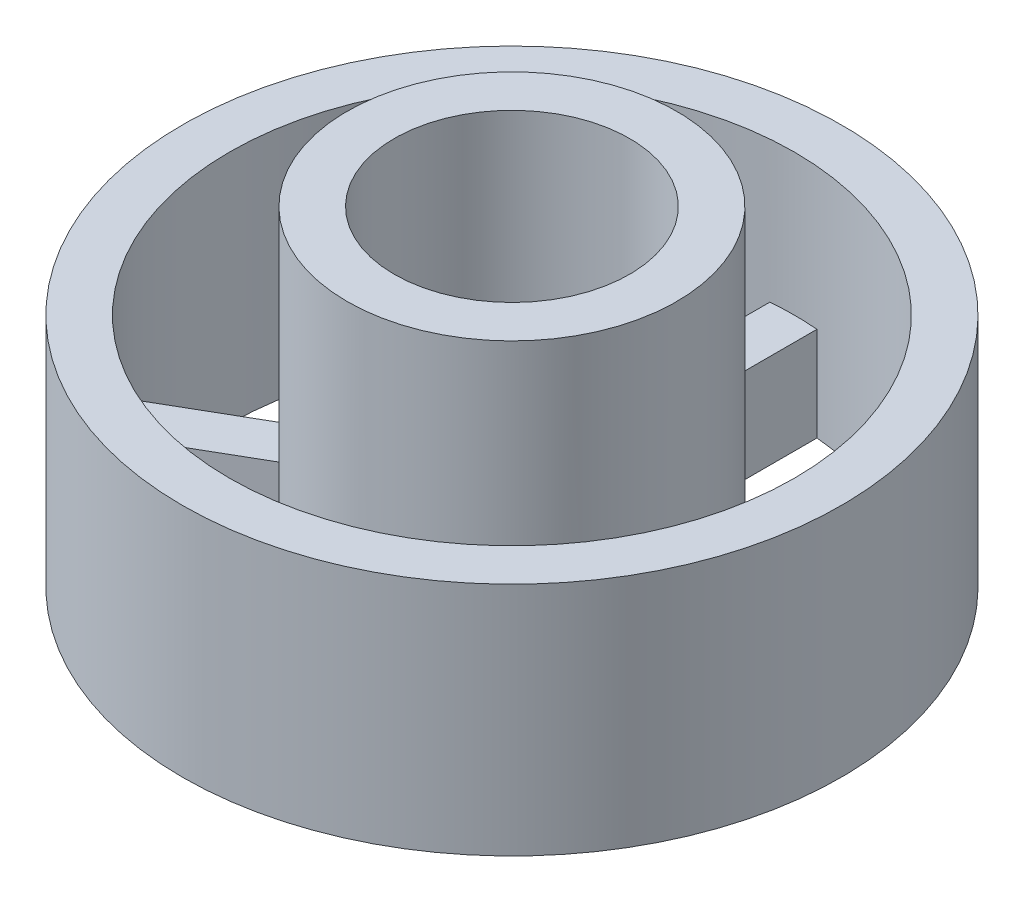
ISO-10303-21;
HEADER;
FILE_DESCRIPTION(('STEP AP214'),'2;1');
FILE_NAME('part.step','',(''),(''),'','','');
FILE_SCHEMA(('AUTOMOTIVE_DESIGN { 1 0 10303 214 1 1 1 1 }'));
ENDSEC;
DATA;
#1=APPLICATION_CONTEXT('core data for automotive mechanical design processes');
#2=APPLICATION_PROTOCOL_DEFINITION('international standard','automotive_design',2000,#1);
#3=PRODUCT_CONTEXT('',#1,'mechanical');
#4=PRODUCT('Part','Part','',(#3));
#5=PRODUCT_RELATED_PRODUCT_CATEGORY('part','',(#4));
#6=PRODUCT_DEFINITION_FORMATION('','',#4);
#7=PRODUCT_DEFINITION_CONTEXT('part definition',#1,'design');
#8=PRODUCT_DEFINITION('design','',#6,#7);
#9=PRODUCT_DEFINITION_SHAPE('','',#8);
#10=(LENGTH_UNIT() NAMED_UNIT(*) SI_UNIT(.MILLI.,.METRE.));
#11=(NAMED_UNIT(*) PLANE_ANGLE_UNIT() SI_UNIT($,.RADIAN.));
#12=(NAMED_UNIT(*) SI_UNIT($,.STERADIAN.) SOLID_ANGLE_UNIT());
#13=UNCERTAINTY_MEASURE_WITH_UNIT(LENGTH_MEASURE(1.E-05),#10,'distance_accuracy_value','');
#14=(GEOMETRIC_REPRESENTATION_CONTEXT(3) GLOBAL_UNCERTAINTY_ASSIGNED_CONTEXT((#13)) GLOBAL_UNIT_ASSIGNED_CONTEXT((#10,
#11,#12)) REPRESENTATION_CONTEXT('',''));
#15=CARTESIAN_POINT('',(0.,0.,0.));
#16=DIRECTION('',(0.,0.,1.));
#17=DIRECTION('',(1.,0.,0.));
#18=AXIS2_PLACEMENT_3D('',#15,#16,#17);
#19=CARTESIAN_POINT('',(0.,2.,0.));
#20=DIRECTION('',(0.,1.,0.));
#21=DIRECTION('',(0.,0.,1.));
#22=AXIS2_PLACEMENT_3D('',#19,#20,#21);
#23=PLANE('',#22);
#24=DIRECTION('',(-0.866025403784436,0.,0.500000000000004));
#25=VECTOR('',#24,1.);
#26=CARTESIAN_POINT('',(-4.92807879430198,2.,3.42257788766759));
#27=LINE('',#26,#25);
#28=CARTESIAN_POINT('',(-2.74999999999999,2.,2.16506350946111));
#29=VERTEX_POINT('',#28);
#30=CARTESIAN_POINT('',(-4.92807879430198,2.,3.42257788766759));
#31=VERTEX_POINT('',#30);
#32=EDGE_CURVE('E177',#29,#31,#27,.T.);
#33=ORIENTED_EDGE('',*,*,#32,.F.);
#34=CARTESIAN_POINT('',(0.,2.,0.));
#35=DIRECTION('',(0.,1.,0.));
#36=DIRECTION('',(0.,0.,1.));
#37=AXIS2_PLACEMENT_3D('',#34,#35,#36);
#38=CIRCLE('',#37,3.5);
#39=CARTESIAN_POINT('',(-3.25,2.,1.29903810567667));
#40=VERTEX_POINT('',#39);
#41=EDGE_CURVE('E255',#40,#29,#38,.T.);
#42=ORIENTED_EDGE('',*,*,#41,.F.);
#43=DIRECTION('',(0.866025403784437,0.,-0.500000000000003));
#44=VECTOR('',#43,1.);
#45=CARTESIAN_POINT('',(-5.42807879430199,2.,2.55655248388315));
#46=LINE('',#45,#44);
#47=CARTESIAN_POINT('',(-5.42807879430199,2.,2.55655248388315));
#48=VERTEX_POINT('',#47);
#49=EDGE_CURVE('E209',#48,#40,#46,.T.);
#50=ORIENTED_EDGE('',*,*,#49,.F.);
#51=CARTESIAN_POINT('',(0.,2.,0.));
#52=DIRECTION('',(0.,1.,0.));
#53=DIRECTION('',(0.,0.,1.));
#54=AXIS2_PLACEMENT_3D('',#51,#52,#53);
#55=CIRCLE('',#54,6.);
#56=EDGE_CURVE('E273',#48,#31,#55,.T.);
#57=ORIENTED_EDGE('',*,*,#56,.T.);
#58=EDGE_LOOP('',(#33,#42,#50,#57));
#59=FACE_BOUND('',#58,.T.);
#60=ADVANCED_FACE('F39',(#59),#23,.T.);
#61=DIRECTION('',(0.,0.,1.));
#62=VECTOR('',#61,1.);
#63=CARTESIAN_POINT('',(0.499999999999998,2.,-5.9791303715507));
#64=LINE('',#63,#62);
#65=CARTESIAN_POINT('',(0.499999999999998,2.,-5.9791303715507));
#66=VERTEX_POINT('',#65);
#67=CARTESIAN_POINT('',(0.499999999999999,2.,-3.46410161513776));
#68=VERTEX_POINT('',#67);
#69=EDGE_CURVE('E165',#66,#68,#64,.T.);
#70=ORIENTED_EDGE('',*,*,#69,.F.);
#71=CARTESIAN_POINT('',(-0.500000000000001,2.,-5.9791303715507));
#72=VERTEX_POINT('',#71);
#73=EDGE_CURVE('E140',#66,#72,#55,.T.);
#74=ORIENTED_EDGE('',*,*,#73,.T.);
#75=DIRECTION('',(0.,0.,-1.));
#76=VECTOR('',#75,1.);
#77=CARTESIAN_POINT('',(-0.500000000000001,2.,-5.9791303715507));
#78=LINE('',#77,#76);
#79=CARTESIAN_POINT('',(-0.5,2.,-3.46410161513776));
#80=VERTEX_POINT('',#79);
#81=EDGE_CURVE('E222',#80,#72,#78,.T.);
#82=ORIENTED_EDGE('',*,*,#81,.F.);
#83=EDGE_CURVE('E268',#68,#80,#38,.T.);
#84=ORIENTED_EDGE('',*,*,#83,.F.);
#85=EDGE_LOOP('',(#70,#74,#82,#84));
#86=FACE_BOUND('',#85,.T.);
#87=ADVANCED_FACE('F285',(#86),#23,.T.);
#88=CARTESIAN_POINT('',(0.,5.,0.));
#89=DIRECTION('',(0.,-1.,0.));
#90=DIRECTION('',(0.,0.,-1.));
#91=AXIS2_PLACEMENT_3D('',#88,#89,#90);
#92=CYLINDRICAL_SURFACE('',#91,7.);
#93=CARTESIAN_POINT('',(0.,5.,0.));
#94=DIRECTION('',(0.,1.,0.));
#95=DIRECTION('',(0.,0.,1.));
#96=AXIS2_PLACEMENT_3D('',#93,#94,#95);
#97=CIRCLE('',#96,7.);
#98=CARTESIAN_POINT('',(0.,5.,7.));
#99=VERTEX_POINT('',#98);
#100=EDGE_CURVE('E11',#99,#99,#97,.T.);
#101=ORIENTED_EDGE('',*,*,#100,.F.);
#102=EDGE_LOOP('',(#101));
#103=FACE_BOUND('',#102,.T.);
#104=CARTESIAN_POINT('',(0.,0.,0.));
#105=DIRECTION('',(0.,1.,0.));
#106=DIRECTION('',(0.,0.,1.));
#107=AXIS2_PLACEMENT_3D('',#104,#105,#106);
#108=CIRCLE('',#107,7.);
#109=CARTESIAN_POINT('',(0.,0.,7.));
#110=VERTEX_POINT('',#109);
#111=EDGE_CURVE('E43',#110,#110,#108,.T.);
#112=ORIENTED_EDGE('',*,*,#111,.T.);
#113=EDGE_LOOP('',(#112));
#114=FACE_BOUND('',#113,.T.);
#115=ADVANCED_FACE('F41',(#103,#114),#92,.T.);
#116=CARTESIAN_POINT('',(0.,5.,0.));
#117=DIRECTION('',(0.,1.,0.));
#118=DIRECTION('',(0.,0.,1.));
#119=AXIS2_PLACEMENT_3D('',#116,#117,#118);
#120=PLANE('',#119);
#121=CARTESIAN_POINT('',(0.,5.,0.));
#122=DIRECTION('',(0.,1.,0.));
#123=DIRECTION('',(0.,0.,1.));
#124=AXIS2_PLACEMENT_3D('',#121,#122,#123);
#125=CIRCLE('',#124,6.);
#126=CARTESIAN_POINT('',(0.,5.,6.));
#127=VERTEX_POINT('',#126);
#128=EDGE_CURVE('E263',#127,#127,#125,.T.);
#129=ORIENTED_EDGE('',*,*,#128,.F.);
#130=EDGE_LOOP('',(#129));
#131=FACE_BOUND('',#130,.T.);
#132=ORIENTED_EDGE('',*,*,#100,.T.);
#133=EDGE_LOOP('',(#132));
#134=FACE_BOUND('',#133,.T.);
#135=ADVANCED_FACE('F342',(#131,#134),#120,.T.);
#136=CARTESIAN_POINT('',(0.,0.,0.));
#137=DIRECTION('',(0.,1.,0.));
#138=DIRECTION('',(0.,0.,1.));
#139=AXIS2_PLACEMENT_3D('',#136,#137,#138);
#140=PLANE('',#139);
#141=DIRECTION('',(-0.866025403784436,0.,-0.500000000000005));
#142=VECTOR('',#141,1.);
#143=CARTESIAN_POINT('',(4.92807879430199,0.,3.42257788766758));
#144=LINE('',#143,#142);
#145=CARTESIAN_POINT('',(4.92807879430199,0.,3.42257788766758));
#146=VERTEX_POINT('',#145);
#147=CARTESIAN_POINT('',(2.75000000000001,0.,2.16506350946109));
#148=VERTEX_POINT('',#147);
#149=EDGE_CURVE('E196',#146,#148,#144,.T.);
#150=ORIENTED_EDGE('',*,*,#149,.T.);
#151=CARTESIAN_POINT('',(0.,0.,0.));
#152=DIRECTION('',(0.,-1.,0.));
#153=DIRECTION('',(0.,0.,1.));
#154=AXIS2_PLACEMENT_3D('',#151,#152,#153);
#155=CIRCLE('',#154,3.5);
#156=CARTESIAN_POINT('',(-2.74999999999999,0.,2.16506350946111));
#157=VERTEX_POINT('',#156);
#158=EDGE_CURVE('E183',#148,#157,#155,.T.);
#159=ORIENTED_EDGE('',*,*,#158,.T.);
#160=DIRECTION('',(-0.866025403784436,0.,0.500000000000004));
#161=VECTOR('',#160,1.);
#162=CARTESIAN_POINT('',(-4.92807879430198,0.,3.42257788766759));
#163=LINE('',#162,#161);
#164=CARTESIAN_POINT('',(-4.92807879430198,0.,3.42257788766759));
#165=VERTEX_POINT('',#164);
#166=EDGE_CURVE('E187',#157,#165,#163,.T.);
#167=ORIENTED_EDGE('',*,*,#166,.T.);
#168=CARTESIAN_POINT('',(0.,0.,0.));
#169=DIRECTION('',(0.,1.,0.));
#170=DIRECTION('',(0.,0.,1.));
#171=AXIS2_PLACEMENT_3D('',#168,#169,#170);
#172=CIRCLE('',#171,6.);
#173=EDGE_CURVE('E192',#165,#146,#172,.T.);
#174=ORIENTED_EDGE('',*,*,#173,.T.);
#175=EDGE_LOOP('',(#150,#159,#167,#174));
#176=FACE_BOUND('',#175,.T.);
#177=DIRECTION('',(0.866025403784436,0.,0.500000000000005));
#178=VECTOR('',#177,1.);
#179=CARTESIAN_POINT('',(5.42807879430198,0.,2.55655248388316));
#180=LINE('',#179,#178);
#181=CARTESIAN_POINT('',(3.24999999999999,0.,1.29903810567668));
#182=VERTEX_POINT('',#181);
#183=CARTESIAN_POINT('',(5.42807879430198,0.,2.55655248388316));
#184=VERTEX_POINT('',#183);
#185=EDGE_CURVE('E146',#182,#184,#180,.T.);
#186=ORIENTED_EDGE('',*,*,#185,.T.);
#187=CARTESIAN_POINT('',(0.,0.,0.));
#188=DIRECTION('',(0.,1.,0.));
#189=DIRECTION('',(0.,0.,1.));
#190=AXIS2_PLACEMENT_3D('',#187,#188,#189);
#191=CIRCLE('',#190,6.);
#192=CARTESIAN_POINT('',(0.499999999999998,0.,-5.9791303715507));
#193=VERTEX_POINT('',#192);
#194=EDGE_CURVE('E137',#184,#193,#191,.T.);
#195=ORIENTED_EDGE('',*,*,#194,.T.);
#196=DIRECTION('',(0.,0.,1.));
#197=VECTOR('',#196,1.);
#198=CARTESIAN_POINT('',(0.499999999999998,0.,-5.9791303715507));
#199=LINE('',#198,#197);
#200=CARTESIAN_POINT('',(0.499999999999999,0.,-3.46410161513776));
#201=VERTEX_POINT('',#200);
#202=EDGE_CURVE('E150',#193,#201,#199,.T.);
#203=ORIENTED_EDGE('',*,*,#202,.T.);
#204=CARTESIAN_POINT('',(0.,0.,0.));
#205=DIRECTION('',(0.,-1.,0.));
#206=DIRECTION('',(0.,0.,1.));
#207=AXIS2_PLACEMENT_3D('',#204,#205,#206);
#208=CIRCLE('',#207,3.5);
#209=EDGE_CURVE('E155',#201,#182,#208,.T.);
#210=ORIENTED_EDGE('',*,*,#209,.T.);
#211=EDGE_LOOP('',(#186,#195,#203,#210));
#212=FACE_BOUND('',#211,.T.);
#213=DIRECTION('',(0.,0.,-1.));
#214=VECTOR('',#213,1.);
#215=CARTESIAN_POINT('',(-0.500000000000001,0.,-5.9791303715507));
#216=LINE('',#215,#214);
#217=CARTESIAN_POINT('',(-0.5,0.,-3.46410161513776));
#218=VERTEX_POINT('',#217);
#219=CARTESIAN_POINT('',(-0.500000000000001,0.,-5.9791303715507));
#220=VERTEX_POINT('',#219);
#221=EDGE_CURVE('E230',#218,#220,#216,.T.);
#222=ORIENTED_EDGE('',*,*,#221,.T.);
#223=CARTESIAN_POINT('',(0.,0.,0.));
#224=DIRECTION('',(0.,1.,0.));
#225=DIRECTION('',(0.,0.,1.));
#226=AXIS2_PLACEMENT_3D('',#223,#224,#225);
#227=CIRCLE('',#226,6.);
#228=CARTESIAN_POINT('',(-5.42807879430199,0.,2.55655248388315));
#229=VERTEX_POINT('',#228);
#230=EDGE_CURVE('E217',#220,#229,#227,.T.);
#231=ORIENTED_EDGE('',*,*,#230,.T.);
#232=DIRECTION('',(0.866025403784437,0.,-0.500000000000003));
#233=VECTOR('',#232,1.);
#234=CARTESIAN_POINT('',(-5.42807879430199,0.,2.55655248388315));
#235=LINE('',#234,#233);
#236=CARTESIAN_POINT('',(-3.25,0.,1.29903810567667));
#237=VERTEX_POINT('',#236);
#238=EDGE_CURVE('E221',#229,#237,#235,.T.);
#239=ORIENTED_EDGE('',*,*,#238,.T.);
#240=CARTESIAN_POINT('',(0.,0.,0.));
#241=DIRECTION('',(0.,-1.,0.));
#242=DIRECTION('',(0.,0.,1.));
#243=AXIS2_PLACEMENT_3D('',#240,#241,#242);
#244=CIRCLE('',#243,3.5);
#245=EDGE_CURVE('E226',#237,#218,#244,.T.);
#246=ORIENTED_EDGE('',*,*,#245,.T.);
#247=EDGE_LOOP('',(#222,#231,#239,#246));
#248=FACE_BOUND('',#247,.T.);
#249=CARTESIAN_POINT('',(0.,0.,0.));
#250=DIRECTION('',(0.,1.,0.));
#251=DIRECTION('',(0.,0.,1.));
#252=AXIS2_PLACEMENT_3D('',#249,#250,#251);
#253=CIRCLE('',#252,2.5);
#254=CARTESIAN_POINT('',(0.,0.,2.5));
#255=VERTEX_POINT('',#254);
#256=EDGE_CURVE('E251',#255,#255,#253,.T.);
#257=ORIENTED_EDGE('',*,*,#256,.T.);
#258=EDGE_LOOP('',(#257));
#259=FACE_BOUND('',#258,.T.);
#260=ORIENTED_EDGE('',*,*,#111,.F.);
#261=EDGE_LOOP('',(#260));
#262=FACE_BOUND('',#261,.T.);
#263=ADVANCED_FACE('F157',(#176,#212,#248,#259,#262),#140,.F.);
#264=CARTESIAN_POINT('',(0.,2.,0.));
#265=DIRECTION('',(0.,1.,0.));
#266=DIRECTION('',(0.,0.,1.));
#267=AXIS2_PLACEMENT_3D('',#264,#265,#266);
#268=CYLINDRICAL_SURFACE('',#267,6.);
#269=CARTESIAN_POINT('',(4.92807879430199,2.,3.42257788766758));
#270=VERTEX_POINT('',#269);
#271=CARTESIAN_POINT('',(5.42807879430198,2.,2.55655248388316));
#272=VERTEX_POINT('',#271);
#273=EDGE_CURVE('E269',#270,#272,#55,.T.);
#274=ORIENTED_EDGE('',*,*,#273,.F.);
#275=DIRECTION('',(0.,1.,0.));
#276=VECTOR('',#275,1.);
#277=CARTESIAN_POINT('',(4.92807879430199,0.,3.42257788766758));
#278=LINE('',#277,#276);
#279=EDGE_CURVE('E55',#146,#270,#278,.T.);
#280=ORIENTED_EDGE('',*,*,#279,.F.);
#281=ORIENTED_EDGE('',*,*,#173,.F.);
#282=DIRECTION('',(0.,1.,0.));
#283=VECTOR('',#282,1.);
#284=CARTESIAN_POINT('',(-4.92807879430198,0.,3.42257788766759));
#285=LINE('',#284,#283);
#286=EDGE_CURVE('E212',#165,#31,#285,.T.);
#287=ORIENTED_EDGE('',*,*,#286,.T.);
#288=ORIENTED_EDGE('',*,*,#56,.F.);
#289=DIRECTION('',(0.,1.,0.));
#290=VECTOR('',#289,1.);
#291=CARTESIAN_POINT('',(-5.42807879430199,0.,2.55655248388315));
#292=LINE('',#291,#290);
#293=EDGE_CURVE('E234',#229,#48,#292,.T.);
#294=ORIENTED_EDGE('',*,*,#293,.F.);
#295=ORIENTED_EDGE('',*,*,#230,.F.);
#296=DIRECTION('',(0.,1.,0.));
#297=VECTOR('',#296,1.);
#298=CARTESIAN_POINT('',(-0.500000000000001,0.,-5.9791303715507));
#299=LINE('',#298,#297);
#300=EDGE_CURVE('E240',#220,#72,#299,.T.);
#301=ORIENTED_EDGE('',*,*,#300,.T.);
#302=ORIENTED_EDGE('',*,*,#73,.F.);
#303=DIRECTION('',(0.,1.,0.));
#304=VECTOR('',#303,1.);
#305=CARTESIAN_POINT('',(0.499999999999998,0.,-5.9791303715507));
#306=LINE('',#305,#304);
#307=EDGE_CURVE('E131',#193,#66,#306,.T.);
#308=ORIENTED_EDGE('',*,*,#307,.F.);
#309=ORIENTED_EDGE('',*,*,#194,.F.);
#310=DIRECTION('',(0.,1.,0.));
#311=VECTOR('',#310,1.);
#312=CARTESIAN_POINT('',(5.42807879430198,0.,2.55655248388316));
#313=LINE('',#312,#311);
#314=EDGE_CURVE('E174',#184,#272,#313,.T.);
#315=ORIENTED_EDGE('',*,*,#314,.T.);
#316=EDGE_LOOP('',(#274,#280,#281,#287,#288,#294,#295,#301,#302,#308,#309,#315));
#317=FACE_BOUND('',#316,.T.);
#318=ORIENTED_EDGE('',*,*,#128,.T.);
#319=EDGE_LOOP('',(#318));
#320=FACE_BOUND('',#319,.T.);
#321=ADVANCED_FACE('F134',(#317,#320),#268,.F.);
#322=DIRECTION('',(-0.866025403784436,0.,-0.500000000000005));
#323=VECTOR('',#322,1.);
#324=CARTESIAN_POINT('',(4.92807879430199,2.,3.42257788766758));
#325=LINE('',#324,#323);
#326=CARTESIAN_POINT('',(2.75000000000001,2.,2.16506350946109));
#327=VERTEX_POINT('',#326);
#328=EDGE_CURVE('E188',#270,#327,#325,.T.);
#329=ORIENTED_EDGE('',*,*,#328,.F.);
#330=ORIENTED_EDGE('',*,*,#273,.T.);
#331=DIRECTION('',(0.866025403784436,0.,0.500000000000005));
#332=VECTOR('',#331,1.);
#333=CARTESIAN_POINT('',(5.42807879430198,2.,2.55655248388316));
#334=LINE('',#333,#332);
#335=CARTESIAN_POINT('',(3.24999999999999,2.,1.29903810567668));
#336=VERTEX_POINT('',#335);
#337=EDGE_CURVE('E161',#336,#272,#334,.T.);
#338=ORIENTED_EDGE('',*,*,#337,.F.);
#339=EDGE_CURVE('E264',#327,#336,#38,.T.);
#340=ORIENTED_EDGE('',*,*,#339,.F.);
#341=EDGE_LOOP('',(#329,#330,#338,#340));
#342=FACE_BOUND('',#341,.T.);
#343=ADVANCED_FACE('F305',(#342),#23,.T.);
#344=CARTESIAN_POINT('',(0.,7.,0.));
#345=DIRECTION('',(0.,-1.,0.));
#346=DIRECTION('',(0.,0.,-1.));
#347=AXIS2_PLACEMENT_3D('',#344,#345,#346);
#348=CYLINDRICAL_SURFACE('',#347,3.5);
#349=CARTESIAN_POINT('',(0.,7.,0.));
#350=DIRECTION('',(0.,1.,0.));
#351=DIRECTION('',(0.,0.,1.));
#352=AXIS2_PLACEMENT_3D('',#349,#350,#351);
#353=CIRCLE('',#352,3.5);
#354=CARTESIAN_POINT('',(0.,7.,3.5));
#355=VERTEX_POINT('',#354);
#356=EDGE_CURVE('E259',#355,#355,#353,.T.);
#357=ORIENTED_EDGE('',*,*,#356,.F.);
#358=EDGE_LOOP('',(#357));
#359=FACE_BOUND('',#358,.T.);
#360=ORIENTED_EDGE('',*,*,#339,.T.);
#361=DIRECTION('',(0.,1.,0.));
#362=VECTOR('',#361,1.);
#363=CARTESIAN_POINT('',(3.24999999999999,0.,1.29903810567668));
#364=LINE('',#363,#362);
#365=EDGE_CURVE('E178',#182,#336,#364,.T.);
#366=ORIENTED_EDGE('',*,*,#365,.F.);
#367=ORIENTED_EDGE('',*,*,#209,.F.);
#368=DIRECTION('',(0.,1.,0.));
#369=VECTOR('',#368,1.);
#370=CARTESIAN_POINT('',(0.499999999999999,0.,-3.46410161513776));
#371=LINE('',#370,#369);
#372=EDGE_CURVE('E145',#201,#68,#371,.T.);
#373=ORIENTED_EDGE('',*,*,#372,.T.);
#374=ORIENTED_EDGE('',*,*,#83,.T.);
#375=DIRECTION('',(0.,1.,0.));
#376=VECTOR('',#375,1.);
#377=CARTESIAN_POINT('',(-0.5,0.,-3.46410161513776));
#378=LINE('',#377,#376);
#379=EDGE_CURVE('E63',#218,#80,#378,.T.);
#380=ORIENTED_EDGE('',*,*,#379,.F.);
#381=ORIENTED_EDGE('',*,*,#245,.F.);
#382=DIRECTION('',(0.,1.,0.));
#383=VECTOR('',#382,1.);
#384=CARTESIAN_POINT('',(-3.25,0.,1.29903810567667));
#385=LINE('',#384,#383);
#386=EDGE_CURVE('E246',#237,#40,#385,.T.);
#387=ORIENTED_EDGE('',*,*,#386,.T.);
#388=ORIENTED_EDGE('',*,*,#41,.T.);
#389=DIRECTION('',(0.,1.,0.));
#390=VECTOR('',#389,1.);
#391=CARTESIAN_POINT('',(-2.74999999999999,0.,2.16506350946111));
#392=LINE('',#391,#390);
#393=EDGE_CURVE('E200',#157,#29,#392,.T.);
#394=ORIENTED_EDGE('',*,*,#393,.F.);
#395=ORIENTED_EDGE('',*,*,#158,.F.);
#396=DIRECTION('',(0.,1.,0.));
#397=VECTOR('',#396,1.);
#398=CARTESIAN_POINT('',(2.75000000000001,0.,2.16506350946109));
#399=LINE('',#398,#397);
#400=EDGE_CURVE('E206',#148,#327,#399,.T.);
#401=ORIENTED_EDGE('',*,*,#400,.T.);
#402=EDGE_LOOP('',(#360,#366,#367,#373,#374,#380,#381,#387,#388,#394,#395,#401));
#403=FACE_BOUND('',#402,.T.);
#404=ADVANCED_FACE('F293',(#359,#403),#348,.T.);
#405=CARTESIAN_POINT('',(0.,7.,0.));
#406=DIRECTION('',(0.,1.,0.));
#407=DIRECTION('',(0.,0.,1.));
#408=AXIS2_PLACEMENT_3D('',#405,#406,#407);
#409=PLANE('',#408);
#410=CARTESIAN_POINT('',(0.,7.,0.));
#411=DIRECTION('',(0.,1.,0.));
#412=DIRECTION('',(0.,0.,1.));
#413=AXIS2_PLACEMENT_3D('',#410,#411,#412);
#414=CIRCLE('',#413,2.5);
#415=CARTESIAN_POINT('',(0.,7.,2.5));
#416=VERTEX_POINT('',#415);
#417=EDGE_CURVE('E243',#416,#416,#414,.T.);
#418=ORIENTED_EDGE('',*,*,#417,.F.);
#419=EDGE_LOOP('',(#418));
#420=FACE_BOUND('',#419,.T.);
#421=ORIENTED_EDGE('',*,*,#356,.T.);
#422=EDGE_LOOP('',(#421));
#423=FACE_BOUND('',#422,.T.);
#424=ADVANCED_FACE('F322',(#420,#423),#409,.T.);
#425=CARTESIAN_POINT('',(0.,0.,0.));
#426=DIRECTION('',(0.,1.,0.));
#427=DIRECTION('',(0.,0.,1.));
#428=AXIS2_PLACEMENT_3D('',#425,#426,#427);
#429=CYLINDRICAL_SURFACE('',#428,2.5);
#430=ORIENTED_EDGE('',*,*,#256,.F.);
#431=EDGE_LOOP('',(#430));
#432=FACE_BOUND('',#431,.T.);
#433=ORIENTED_EDGE('',*,*,#417,.T.);
#434=EDGE_LOOP('',(#433));
#435=FACE_BOUND('',#434,.T.);
#436=ADVANCED_FACE('F315',(#432,#435),#429,.F.);
#437=CARTESIAN_POINT('',(-0.500000000000001,0.,-5.9791303715507));
#438=DIRECTION('',(1.,0.,0.));
#439=DIRECTION('',(0.,0.,-1.));
#440=AXIS2_PLACEMENT_3D('',#437,#438,#439);
#441=PLANE('',#440);
#442=ORIENTED_EDGE('',*,*,#81,.T.);
#443=ORIENTED_EDGE('',*,*,#300,.F.);
#444=ORIENTED_EDGE('',*,*,#221,.F.);
#445=ORIENTED_EDGE('',*,*,#379,.T.);
#446=EDGE_LOOP('',(#442,#443,#444,#445));
#447=FACE_BOUND('',#446,.T.);
#448=ADVANCED_FACE('F313',(#447),#441,.F.);
#449=CARTESIAN_POINT('',(-5.42807879430199,0.,2.55655248388315));
#450=DIRECTION('',(0.500000000000003,0.,0.866025403784437));
#451=DIRECTION('',(0.866025403784437,0.,-0.500000000000003));
#452=AXIS2_PLACEMENT_3D('',#449,#450,#451);
#453=PLANE('',#452);
#454=ORIENTED_EDGE('',*,*,#49,.T.);
#455=ORIENTED_EDGE('',*,*,#386,.F.);
#456=ORIENTED_EDGE('',*,*,#238,.F.);
#457=ORIENTED_EDGE('',*,*,#293,.T.);
#458=EDGE_LOOP('',(#454,#455,#456,#457));
#459=FACE_BOUND('',#458,.T.);
#460=ADVANCED_FACE('F311',(#459),#453,.F.);
#461=CARTESIAN_POINT('',(5.42807879430198,0.,2.55655248388316));
#462=DIRECTION('',(-0.500000000000005,0.,0.866025403784436));
#463=DIRECTION('',(0.866025403784436,0.,0.500000000000005));
#464=AXIS2_PLACEMENT_3D('',#461,#462,#463);
#465=PLANE('',#464);
#466=ORIENTED_EDGE('',*,*,#337,.T.);
#467=ORIENTED_EDGE('',*,*,#314,.F.);
#468=ORIENTED_EDGE('',*,*,#185,.F.);
#469=ORIENTED_EDGE('',*,*,#365,.T.);
#470=EDGE_LOOP('',(#466,#467,#468,#469));
#471=FACE_BOUND('',#470,.T.);
#472=ADVANCED_FACE('F307',(#471),#465,.F.);
#473=CARTESIAN_POINT('',(0.499999999999998,0.,-5.9791303715507));
#474=DIRECTION('',(-1.,0.,0.));
#475=DIRECTION('',(0.,0.,1.));
#476=AXIS2_PLACEMENT_3D('',#473,#474,#475);
#477=PLANE('',#476);
#478=ORIENTED_EDGE('',*,*,#69,.T.);
#479=ORIENTED_EDGE('',*,*,#372,.F.);
#480=ORIENTED_EDGE('',*,*,#202,.F.);
#481=ORIENTED_EDGE('',*,*,#307,.T.);
#482=EDGE_LOOP('',(#478,#479,#480,#481));
#483=FACE_BOUND('',#482,.T.);
#484=ADVANCED_FACE('F151',(#483),#477,.F.);
#485=CARTESIAN_POINT('',(4.92807879430199,0.,3.42257788766758));
#486=DIRECTION('',(0.500000000000005,0.,-0.866025403784436));
#487=DIRECTION('',(-0.866025403784436,0.,-0.500000000000005));
#488=AXIS2_PLACEMENT_3D('',#485,#486,#487);
#489=PLANE('',#488);
#490=ORIENTED_EDGE('',*,*,#328,.T.);
#491=ORIENTED_EDGE('',*,*,#400,.F.);
#492=ORIENTED_EDGE('',*,*,#149,.F.);
#493=ORIENTED_EDGE('',*,*,#279,.T.);
#494=EDGE_LOOP('',(#490,#491,#492,#493));
#495=FACE_BOUND('',#494,.T.);
#496=ADVANCED_FACE('F302',(#495),#489,.F.);
#497=CARTESIAN_POINT('',(-4.92807879430198,0.,3.42257788766759));
#498=DIRECTION('',(-0.500000000000004,0.,-0.866025403784436));
#499=DIRECTION('',(-0.866025403784436,0.,0.500000000000004));
#500=AXIS2_PLACEMENT_3D('',#497,#498,#499);
#501=PLANE('',#500);
#502=ORIENTED_EDGE('',*,*,#32,.T.);
#503=ORIENTED_EDGE('',*,*,#286,.F.);
#504=ORIENTED_EDGE('',*,*,#166,.F.);
#505=ORIENTED_EDGE('',*,*,#393,.T.);
#506=EDGE_LOOP('',(#502,#503,#504,#505));
#507=FACE_BOUND('',#506,.T.);
#508=ADVANCED_FACE('F299',(#507),#501,.F.);
#509=CLOSED_SHELL('',(#60,#87,#115,#135,#263,#321,#343,#404,#424,#436,#448,#460,#472,#484,#496,#508));
#510=MANIFOLD_SOLID_BREP('B2',#509);
#511=ADVANCED_BREP_SHAPE_REPRESENTATION('',(#18,#510),#14);
#512=SHAPE_DEFINITION_REPRESENTATION(#9,#511);
ENDSEC;
END-ISO-10303-21;
